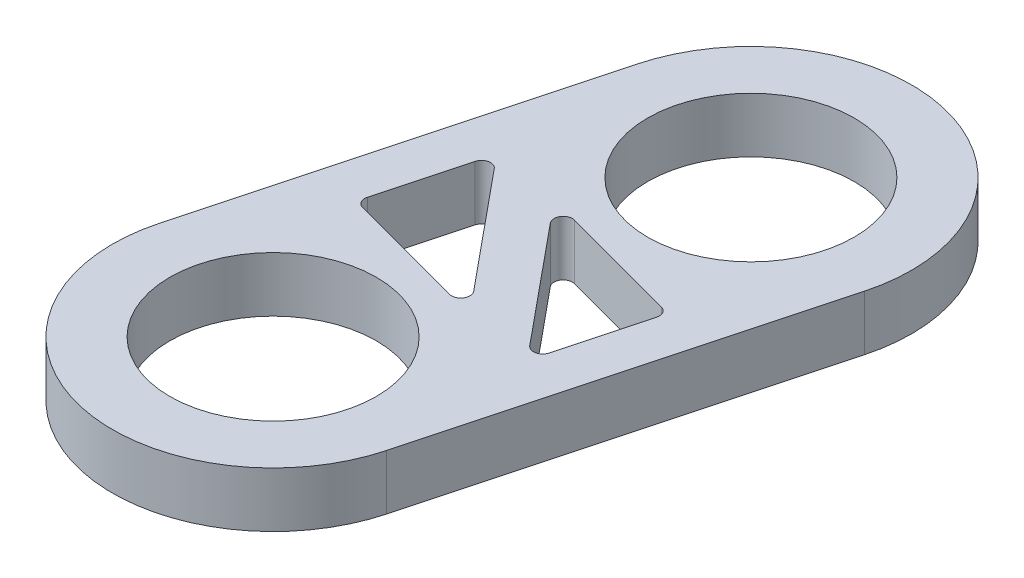
ISO-10303-21;
HEADER;
FILE_DESCRIPTION(('STEP AP214'),'2;1');
FILE_NAME('part.step','',(''),(''),'','','');
FILE_SCHEMA(('AUTOMOTIVE_DESIGN { 1 0 10303 214 1 1 1 1 }'));
ENDSEC;
DATA;
#1=APPLICATION_CONTEXT('core data for automotive mechanical design processes');
#2=APPLICATION_PROTOCOL_DEFINITION('international standard','automotive_design',2000,#1);
#3=PRODUCT_CONTEXT('',#1,'mechanical');
#4=PRODUCT('Part','Part','',(#3));
#5=PRODUCT_RELATED_PRODUCT_CATEGORY('part','',(#4));
#6=PRODUCT_DEFINITION_FORMATION('','',#4);
#7=PRODUCT_DEFINITION_CONTEXT('part definition',#1,'design');
#8=PRODUCT_DEFINITION('design','',#6,#7);
#9=PRODUCT_DEFINITION_SHAPE('','',#8);
#10=(LENGTH_UNIT() NAMED_UNIT(*) SI_UNIT(.MILLI.,.METRE.));
#11=(NAMED_UNIT(*) PLANE_ANGLE_UNIT() SI_UNIT($,.RADIAN.));
#12=(NAMED_UNIT(*) SI_UNIT($,.STERADIAN.) SOLID_ANGLE_UNIT());
#13=UNCERTAINTY_MEASURE_WITH_UNIT(LENGTH_MEASURE(1.E-05),#10,'distance_accuracy_value','');
#14=(GEOMETRIC_REPRESENTATION_CONTEXT(3) GLOBAL_UNCERTAINTY_ASSIGNED_CONTEXT((#13)) GLOBAL_UNIT_ASSIGNED_CONTEXT((#10,
#11,#12)) REPRESENTATION_CONTEXT('',''));
#15=CARTESIAN_POINT('',(0.,0.,0.));
#16=DIRECTION('',(0.,0.,1.));
#17=DIRECTION('',(1.,0.,0.));
#18=AXIS2_PLACEMENT_3D('',#15,#16,#17);
#19=CARTESIAN_POINT('',(0.,7.62,0.));
#20=DIRECTION('',(0.,-1.,0.));
#21=DIRECTION('',(0.,0.,-1.));
#22=AXIS2_PLACEMENT_3D('',#19,#20,#21);
#23=PLANE('',#22);
#24=DIRECTION('',(0.258819045102514,0.,-0.96592582628907));
#25=VECTOR('',#24,1.);
#26=CARTESIAN_POINT('',(10.5329748694649,7.62,22.0266926016672));
#27=LINE('',#26,#25);
#28=CARTESIAN_POINT('',(7.06294922313717,7.62,34.9770046173296));
#29=VERTEX_POINT('',#28);
#30=CARTESIAN_POINT('',(10.2042746821847,7.62,23.2534184010544));
#31=VERTEX_POINT('',#30);
#32=EDGE_CURVE('E366',#29,#31,#27,.T.);
#33=ORIENTED_EDGE('',*,*,#32,.F.);
#34=CARTESIAN_POINT('',(5.83622342375006,7.62,34.6483044300494));
#35=DIRECTION('',(0.,-1.,0.));
#36=DIRECTION('',(0.,0.,-1.));
#37=AXIS2_PLACEMENT_3D('',#34,#35,#36);
#38=CIRCLE('',#37,1.27);
#39=CARTESIAN_POINT('',(4.85572919154385,7.62,35.4554791698737));
#40=VERTEX_POINT('',#39);
#41=EDGE_CURVE('E207',#29,#40,#38,.T.);
#42=ORIENTED_EDGE('',*,*,#41,.T.);
#43=DIRECTION('',(0.635570661278952,0.,0.772042702524566));
#44=VECTOR('',#43,1.);
#45=CARTESIAN_POINT('',(6.42422252846246,7.62,37.3607650940062));
#46=LINE('',#45,#44);
#47=CARTESIAN_POINT('',(-8.41596605219397,7.62,19.3340373109319));
#48=VERTEX_POINT('',#47);
#49=EDGE_CURVE('E371',#48,#40,#46,.T.);
#50=ORIENTED_EDGE('',*,*,#49,.F.);
#51=CARTESIAN_POINT('',(-7.43547181998776,7.62,18.5268625711077));
#52=DIRECTION('',(0.,-1.,0.));
#53=DIRECTION('',(0.,0.,-1.));
#54=AXIS2_PLACEMENT_3D('',#51,#52,#53);
#55=CIRCLE('',#54,1.27);
#56=CARTESIAN_POINT('',(-7.10677163270757,7.62,17.3001367717205));
#57=VERTEX_POINT('',#56);
#58=EDGE_CURVE('E215',#48,#57,#55,.T.);
#59=ORIENTED_EDGE('',*,*,#58,.T.);
#60=DIRECTION('',(-0.96592582628907,0.,-0.258819045102514));
#61=VECTOR('',#60,1.);
#62=CARTESIAN_POINT('',(-10.9347266198097,7.62,16.2744393242639));
#63=LINE('',#62,#61);
#64=CARTESIAN_POINT('',(9.30624907007775,7.62,21.697992414387));
#65=VERTEX_POINT('',#64);
#66=EDGE_CURVE('E367',#65,#57,#63,.T.);
#67=ORIENTED_EDGE('',*,*,#66,.F.);
#68=CARTESIAN_POINT('',(8.97754888279756,7.62,22.9247182137742));
#69=DIRECTION('',(0.,-1.,0.));
#70=DIRECTION('',(0.,0.,-1.));
#71=AXIS2_PLACEMENT_3D('',#68,#69,#70);
#72=CIRCLE('',#71,1.27);
#73=EDGE_CURVE('E211',#65,#31,#72,.T.);
#74=ORIENTED_EDGE('',*,*,#73,.T.);
#75=EDGE_LOOP('',(#33,#42,#50,#59,#67,#74));
#76=FACE_BOUND('',#75,.T.);
#77=DIRECTION('',(0.96592582628907,0.,0.258819045102514));
#78=VECTOR('',#77,1.);
#79=CARTESIAN_POINT('',(-3.0350313395985,7.62,35.8614071496887));
#80=LINE('',#79,#78);
#81=CARTESIAN_POINT('',(-23.276007029486,7.62,30.4378540595655));
#82=VERTEX_POINT('',#81);
#83=CARTESIAN_POINT('',(-6.86298632670064,7.62,34.835709702232));
#84=VERTEX_POINT('',#83);
#85=EDGE_CURVE('E228',#82,#84,#80,.T.);
#86=ORIENTED_EDGE('',*,*,#85,.F.);
#87=CARTESIAN_POINT('',(-22.9473068422058,7.62,29.2111282601784));
#88=DIRECTION('',(0.,-1.,0.));
#89=DIRECTION('',(0.,0.,-1.));
#90=AXIS2_PLACEMENT_3D('',#87,#88,#89);
#91=CIRCLE('',#90,1.27);
#92=CARTESIAN_POINT('',(-24.1740326415929,7.62,28.8824280728982));
#93=VERTEX_POINT('',#92);
#94=EDGE_CURVE('E223',#82,#93,#91,.T.);
#95=ORIENTED_EDGE('',*,*,#94,.T.);
#96=DIRECTION('',(-0.258819045102514,0.,0.96592582628907));
#97=VECTOR('',#96,1.);
#98=CARTESIAN_POINT('',(-24.5027328288731,7.62,30.1091538722853));
#99=LINE('',#98,#97);
#100=CARTESIAN_POINT('',(-21.0327071825454,7.62,17.158841856623));
#101=VERTEX_POINT('',#100);
#102=EDGE_CURVE('E235',#101,#93,#99,.T.);
#103=ORIENTED_EDGE('',*,*,#102,.F.);
#104=CARTESIAN_POINT('',(-19.8059813831583,7.62,17.4875420439032));
#105=DIRECTION('',(0.,-1.,0.));
#106=DIRECTION('',(0.,0.,-1.));
#107=AXIS2_PLACEMENT_3D('',#104,#105,#106);
#108=CIRCLE('',#107,1.27);
#109=CARTESIAN_POINT('',(-18.8254871509521,7.62,16.6803673040789));
#110=VERTEX_POINT('',#109);
#111=EDGE_CURVE('E219',#101,#110,#108,.T.);
#112=ORIENTED_EDGE('',*,*,#111,.T.);
#113=DIRECTION('',(-0.635570661278952,0.,-0.772042702524566));
#114=VECTOR('',#113,1.);
#115=CARTESIAN_POINT('',(-20.3939804878707,7.62,14.7750813799463));
#116=LINE('',#115,#114);
#117=CARTESIAN_POINT('',(-5.55379190721425,7.62,32.8018091630206));
#118=VERTEX_POINT('',#117);
#119=EDGE_CURVE('E230',#118,#110,#116,.T.);
#120=ORIENTED_EDGE('',*,*,#119,.F.);
#121=CARTESIAN_POINT('',(-6.53428613942045,7.62,33.6089839028449));
#122=DIRECTION('',(0.,-1.,0.));
#123=DIRECTION('',(0.,0.,-1.));
#124=AXIS2_PLACEMENT_3D('',#121,#122,#123);
#125=CIRCLE('',#124,1.27);
#126=EDGE_CURVE('E43',#118,#84,#125,.T.);
#127=ORIENTED_EDGE('',*,*,#126,.T.);
#128=EDGE_LOOP('',(#86,#95,#103,#112,#120,#127));
#129=FACE_BOUND('',#128,.T.);
#130=CARTESIAN_POINT('',(0.,7.62,0.));
#131=DIRECTION('',(0.,1.,0.));
#132=DIRECTION('',(0.,0.,-1.));
#133=AXIS2_PLACEMENT_3D('',#130,#131,#132);
#134=CIRCLE('',#133,22.225);
#135=CARTESIAN_POINT('',(21.4677014892746,7.62,5.75225327740338));
#136=VERTEX_POINT('',#135);
#137=CARTESIAN_POINT('',(-21.4677014892746,7.62,-5.75225327740338));
#138=VERTEX_POINT('',#137);
#139=EDGE_CURVE('E159',#136,#138,#134,.T.);
#140=ORIENTED_EDGE('',*,*,#139,.T.);
#141=DIRECTION('',(-0.258819045102514,0.,0.96592582628907));
#142=VECTOR('',#141,1.);
#143=CARTESIAN_POINT('',(-35.4374594486828,7.62,46.3835931965492));
#144=LINE('',#143,#142);
#145=CARTESIAN_POINT('',(-35.4374594486828,7.62,46.3835931965492));
#146=VERTEX_POINT('',#145);
#147=EDGE_CURVE('E149',#138,#146,#144,.T.);
#148=ORIENTED_EDGE('',*,*,#147,.T.);
#149=CARTESIAN_POINT('',(-13.9697579594082,7.62,52.1358464739525));
#150=DIRECTION('',(0.,1.,0.));
#151=DIRECTION('',(0.,0.,1.));
#152=AXIS2_PLACEMENT_3D('',#149,#150,#151);
#153=CIRCLE('',#152,22.225);
#154=CARTESIAN_POINT('',(7.49794352986636,7.62,57.8880997513559));
#155=VERTEX_POINT('',#154);
#156=EDGE_CURVE('E158',#146,#155,#153,.T.);
#157=ORIENTED_EDGE('',*,*,#156,.T.);
#158=DIRECTION('',(0.258819045102515,0.,-0.96592582628907));
#159=VECTOR('',#158,1.);
#160=CARTESIAN_POINT('',(7.49794352986636,7.62,57.8880997513559));
#161=LINE('',#160,#159);
#162=EDGE_CURVE('E164',#155,#136,#161,.T.);
#163=ORIENTED_EDGE('',*,*,#162,.T.);
#164=EDGE_LOOP('',(#140,#148,#157,#163));
#165=FACE_BOUND('',#164,.T.);
#166=CARTESIAN_POINT('',(-13.9697579594082,7.62,52.1358464739525));
#167=DIRECTION('',(0.,1.,0.));
#168=DIRECTION('',(0.,0.,1.));
#169=AXIS2_PLACEMENT_3D('',#166,#167,#168);
#170=CIRCLE('',#169,14.2875);
#171=CARTESIAN_POINT('',(-13.9697579594082,7.62,66.4233464739525));
#172=VERTEX_POINT('',#171);
#173=EDGE_CURVE('E264',#172,#172,#170,.T.);
#174=ORIENTED_EDGE('',*,*,#173,.F.);
#175=EDGE_LOOP('',(#174));
#176=FACE_BOUND('',#175,.T.);
#177=CARTESIAN_POINT('',(0.,7.62,0.));
#178=DIRECTION('',(0.,1.,0.));
#179=DIRECTION('',(0.,0.,1.));
#180=AXIS2_PLACEMENT_3D('',#177,#178,#179);
#181=CIRCLE('',#180,14.2875);
#182=CARTESIAN_POINT('',(0.,7.62,14.2875));
#183=VERTEX_POINT('',#182);
#184=EDGE_CURVE('E251',#183,#183,#181,.T.);
#185=ORIENTED_EDGE('',*,*,#184,.F.);
#186=EDGE_LOOP('',(#185));
#187=FACE_BOUND('',#186,.T.);
#188=ADVANCED_FACE('F35',(#76,#129,#165,#176,#187),#23,.F.);
#189=CARTESIAN_POINT('',(0.,0.,0.));
#190=DIRECTION('',(0.,-1.,0.));
#191=DIRECTION('',(0.,0.,-1.));
#192=AXIS2_PLACEMENT_3D('',#189,#190,#191);
#193=PLANE('',#192);
#194=DIRECTION('',(-0.96592582628907,0.,-0.258819045102514));
#195=VECTOR('',#194,1.);
#196=CARTESIAN_POINT('',(-10.9347266198097,0.,16.2744393242639));
#197=LINE('',#196,#195);
#198=CARTESIAN_POINT('',(9.30624907007775,0.,21.697992414387));
#199=VERTEX_POINT('',#198);
#200=CARTESIAN_POINT('',(-7.10677163270757,0.,17.3001367717205));
#201=VERTEX_POINT('',#200);
#202=EDGE_CURVE('E258',#199,#201,#197,.T.);
#203=ORIENTED_EDGE('',*,*,#202,.T.);
#204=CARTESIAN_POINT('',(-7.43547181998776,0.,18.5268625711077));
#205=DIRECTION('',(0.,-1.,0.));
#206=DIRECTION('',(0.,0.,-1.));
#207=AXIS2_PLACEMENT_3D('',#204,#205,#206);
#208=CIRCLE('',#207,1.27);
#209=CARTESIAN_POINT('',(-8.41596605219397,0.,19.3340373109319));
#210=VERTEX_POINT('',#209);
#211=EDGE_CURVE('E217',#201,#210,#208,.F.);
#212=ORIENTED_EDGE('',*,*,#211,.T.);
#213=DIRECTION('',(0.635570661278952,0.,0.772042702524566));
#214=VECTOR('',#213,1.);
#215=CARTESIAN_POINT('',(6.42422252846246,0.,37.3607650940062));
#216=LINE('',#215,#214);
#217=CARTESIAN_POINT('',(4.85572919154385,0.,35.4554791698737));
#218=VERTEX_POINT('',#217);
#219=EDGE_CURVE('E373',#210,#218,#216,.T.);
#220=ORIENTED_EDGE('',*,*,#219,.T.);
#221=CARTESIAN_POINT('',(5.83622342375006,0.,34.6483044300494));
#222=DIRECTION('',(0.,-1.,0.));
#223=DIRECTION('',(0.,0.,-1.));
#224=AXIS2_PLACEMENT_3D('',#221,#222,#223);
#225=CIRCLE('',#224,1.27);
#226=CARTESIAN_POINT('',(7.06294922313717,0.,34.9770046173296));
#227=VERTEX_POINT('',#226);
#228=EDGE_CURVE('E209',#218,#227,#225,.F.);
#229=ORIENTED_EDGE('',*,*,#228,.T.);
#230=DIRECTION('',(0.258819045102514,0.,-0.96592582628907));
#231=VECTOR('',#230,1.);
#232=CARTESIAN_POINT('',(10.5329748694649,0.,22.0266926016672));
#233=LINE('',#232,#231);
#234=CARTESIAN_POINT('',(10.2042746821847,0.,23.2534184010544));
#235=VERTEX_POINT('',#234);
#236=EDGE_CURVE('E359',#227,#235,#233,.T.);
#237=ORIENTED_EDGE('',*,*,#236,.T.);
#238=CARTESIAN_POINT('',(8.97754888279756,0.,22.9247182137742));
#239=DIRECTION('',(0.,-1.,0.));
#240=DIRECTION('',(0.,0.,-1.));
#241=AXIS2_PLACEMENT_3D('',#238,#239,#240);
#242=CIRCLE('',#241,1.27);
#243=EDGE_CURVE('E213',#235,#199,#242,.F.);
#244=ORIENTED_EDGE('',*,*,#243,.T.);
#245=EDGE_LOOP('',(#203,#212,#220,#229,#237,#244));
#246=FACE_BOUND('',#245,.T.);
#247=DIRECTION('',(-0.635570661278952,0.,-0.772042702524566));
#248=VECTOR('',#247,1.);
#249=CARTESIAN_POINT('',(-20.3939804878707,0.,14.7750813799463));
#250=LINE('',#249,#248);
#251=CARTESIAN_POINT('',(-5.55379190721425,0.,32.8018091630206));
#252=VERTEX_POINT('',#251);
#253=CARTESIAN_POINT('',(-18.8254871509521,0.,16.6803673040789));
#254=VERTEX_POINT('',#253);
#255=EDGE_CURVE('E242',#252,#254,#250,.T.);
#256=ORIENTED_EDGE('',*,*,#255,.T.);
#257=CARTESIAN_POINT('',(-19.8059813831583,0.,17.4875420439032));
#258=DIRECTION('',(0.,-1.,0.));
#259=DIRECTION('',(0.,0.,-1.));
#260=AXIS2_PLACEMENT_3D('',#257,#258,#259);
#261=CIRCLE('',#260,1.27);
#262=CARTESIAN_POINT('',(-21.0327071825454,0.,17.158841856623));
#263=VERTEX_POINT('',#262);
#264=EDGE_CURVE('E221',#254,#263,#261,.F.);
#265=ORIENTED_EDGE('',*,*,#264,.T.);
#266=DIRECTION('',(-0.258819045102514,0.,0.96592582628907));
#267=VECTOR('',#266,1.);
#268=CARTESIAN_POINT('',(-24.5027328288731,0.,30.1091538722853));
#269=LINE('',#268,#267);
#270=CARTESIAN_POINT('',(-24.1740326415929,0.,28.8824280728982));
#271=VERTEX_POINT('',#270);
#272=EDGE_CURVE('E253',#263,#271,#269,.T.);
#273=ORIENTED_EDGE('',*,*,#272,.T.);
#274=CARTESIAN_POINT('',(-22.9473068422058,0.,29.2111282601784));
#275=DIRECTION('',(0.,-1.,0.));
#276=DIRECTION('',(0.,0.,-1.));
#277=AXIS2_PLACEMENT_3D('',#274,#275,#276);
#278=CIRCLE('',#277,1.27);
#279=CARTESIAN_POINT('',(-23.276007029486,0.,30.4378540595655));
#280=VERTEX_POINT('',#279);
#281=EDGE_CURVE('E57',#271,#280,#278,.F.);
#282=ORIENTED_EDGE('',*,*,#281,.T.);
#283=DIRECTION('',(0.96592582628907,0.,0.258819045102514));
#284=VECTOR('',#283,1.);
#285=CARTESIAN_POINT('',(-3.0350313395985,0.,35.8614071496887));
#286=LINE('',#285,#284);
#287=CARTESIAN_POINT('',(-6.86298632670064,0.,34.835709702232));
#288=VERTEX_POINT('',#287);
#289=EDGE_CURVE('E244',#280,#288,#286,.T.);
#290=ORIENTED_EDGE('',*,*,#289,.T.);
#291=CARTESIAN_POINT('',(-6.53428613942045,0.,33.6089839028449));
#292=DIRECTION('',(0.,-1.,0.));
#293=DIRECTION('',(0.,0.,-1.));
#294=AXIS2_PLACEMENT_3D('',#291,#292,#293);
#295=CIRCLE('',#294,1.27);
#296=EDGE_CURVE('E11',#288,#252,#295,.F.);
#297=ORIENTED_EDGE('',*,*,#296,.T.);
#298=EDGE_LOOP('',(#256,#265,#273,#282,#290,#297));
#299=FACE_BOUND('',#298,.T.);
#300=CARTESIAN_POINT('',(-13.9697579594082,0.,52.1358464739525));
#301=DIRECTION('',(0.,1.,0.));
#302=DIRECTION('',(0.,0.,1.));
#303=AXIS2_PLACEMENT_3D('',#300,#301,#302);
#304=CIRCLE('',#303,14.2875);
#305=CARTESIAN_POINT('',(-13.9697579594082,0.,66.4233464739525));
#306=VERTEX_POINT('',#305);
#307=EDGE_CURVE('E262',#306,#306,#304,.T.);
#308=ORIENTED_EDGE('',*,*,#307,.T.);
#309=EDGE_LOOP('',(#308));
#310=FACE_BOUND('',#309,.T.);
#311=DIRECTION('',(-0.258819045102514,0.,0.96592582628907));
#312=VECTOR('',#311,1.);
#313=CARTESIAN_POINT('',(-35.4374594486828,0.,46.3835931965492));
#314=LINE('',#313,#312);
#315=CARTESIAN_POINT('',(-21.4677014892746,0.,-5.75225327740338));
#316=VERTEX_POINT('',#315);
#317=CARTESIAN_POINT('',(-35.4374594486828,0.,46.3835931965492));
#318=VERTEX_POINT('',#317);
#319=EDGE_CURVE('E267',#316,#318,#314,.T.);
#320=ORIENTED_EDGE('',*,*,#319,.F.);
#321=CARTESIAN_POINT('',(0.,0.,0.));
#322=DIRECTION('',(0.,1.,0.));
#323=DIRECTION('',(0.,0.,1.));
#324=AXIS2_PLACEMENT_3D('',#321,#322,#323);
#325=CIRCLE('',#324,22.225);
#326=CARTESIAN_POINT('',(21.4677014892746,0.,5.75225327740338));
#327=VERTEX_POINT('',#326);
#328=EDGE_CURVE('E168',#327,#316,#325,.T.);
#329=ORIENTED_EDGE('',*,*,#328,.F.);
#330=DIRECTION('',(0.258819045102515,0.,-0.96592582628907));
#331=VECTOR('',#330,1.);
#332=CARTESIAN_POINT('',(7.49794352986636,0.,57.8880997513559));
#333=LINE('',#332,#331);
#334=CARTESIAN_POINT('',(7.49794352986636,0.,57.8880997513559));
#335=VERTEX_POINT('',#334);
#336=EDGE_CURVE('E276',#335,#327,#333,.T.);
#337=ORIENTED_EDGE('',*,*,#336,.F.);
#338=CARTESIAN_POINT('',(-13.9697579594082,0.,52.1358464739525));
#339=DIRECTION('',(0.,1.,0.));
#340=DIRECTION('',(0.,0.,1.));
#341=AXIS2_PLACEMENT_3D('',#338,#339,#340);
#342=CIRCLE('',#341,22.225);
#343=EDGE_CURVE('E274',#318,#335,#342,.T.);
#344=ORIENTED_EDGE('',*,*,#343,.F.);
#345=EDGE_LOOP('',(#320,#329,#337,#344));
#346=FACE_BOUND('',#345,.T.);
#347=CARTESIAN_POINT('',(0.,0.,0.));
#348=DIRECTION('',(0.,1.,0.));
#349=DIRECTION('',(0.,0.,1.));
#350=AXIS2_PLACEMENT_3D('',#347,#348,#349);
#351=CIRCLE('',#350,14.2875);
#352=CARTESIAN_POINT('',(0.,0.,14.2875));
#353=VERTEX_POINT('',#352);
#354=EDGE_CURVE('E248',#353,#353,#351,.T.);
#355=ORIENTED_EDGE('',*,*,#354,.T.);
#356=EDGE_LOOP('',(#355));
#357=FACE_BOUND('',#356,.T.);
#358=ADVANCED_FACE('F240',(#246,#299,#310,#346,#357),#193,.T.);
#359=CARTESIAN_POINT('',(-35.4374594486828,7.62,46.3835931965492));
#360=DIRECTION('',(0.96592582628907,0.,0.258819045102514));
#361=DIRECTION('',(0.258819045102514,0.,-0.96592582628907));
#362=AXIS2_PLACEMENT_3D('',#359,#360,#361);
#363=PLANE('',#362);
#364=ORIENTED_EDGE('',*,*,#319,.T.);
#365=DIRECTION('',(0.,-1.,0.));
#366=VECTOR('',#365,1.);
#367=CARTESIAN_POINT('',(-35.4374594486828,7.62,46.3835931965492));
#368=LINE('',#367,#366);
#369=EDGE_CURVE('E155',#146,#318,#368,.T.);
#370=ORIENTED_EDGE('',*,*,#369,.F.);
#371=ORIENTED_EDGE('',*,*,#147,.F.);
#372=DIRECTION('',(0.,-1.,0.));
#373=VECTOR('',#372,1.);
#374=CARTESIAN_POINT('',(-21.4677014892746,7.62,-5.75225327740338));
#375=LINE('',#374,#373);
#376=EDGE_CURVE('E153',#138,#316,#375,.T.);
#377=ORIENTED_EDGE('',*,*,#376,.T.);
#378=EDGE_LOOP('',(#364,#370,#371,#377));
#379=FACE_BOUND('',#378,.T.);
#380=ADVANCED_FACE('F151',(#379),#363,.F.);
#381=CARTESIAN_POINT('',(-13.9697579594082,7.62,52.1358464739525));
#382=DIRECTION('',(0.,-1.,0.));
#383=DIRECTION('',(0.,0.,-1.));
#384=AXIS2_PLACEMENT_3D('',#381,#382,#383);
#385=CYLINDRICAL_SURFACE('',#384,22.225);
#386=ORIENTED_EDGE('',*,*,#343,.T.);
#387=DIRECTION('',(0.,-1.,0.));
#388=VECTOR('',#387,1.);
#389=CARTESIAN_POINT('',(7.49794352986636,7.62,57.8880997513559));
#390=LINE('',#389,#388);
#391=EDGE_CURVE('E177',#155,#335,#390,.T.);
#392=ORIENTED_EDGE('',*,*,#391,.F.);
#393=ORIENTED_EDGE('',*,*,#156,.F.);
#394=ORIENTED_EDGE('',*,*,#369,.T.);
#395=EDGE_LOOP('',(#386,#392,#393,#394));
#396=FACE_BOUND('',#395,.T.);
#397=ADVANCED_FACE('F288',(#396),#385,.T.);
#398=CARTESIAN_POINT('',(7.49794352986636,7.62,57.8880997513559));
#399=DIRECTION('',(-0.96592582628907,0.,-0.258819045102515));
#400=DIRECTION('',(-0.258819045102515,0.,0.96592582628907));
#401=AXIS2_PLACEMENT_3D('',#398,#399,#400);
#402=PLANE('',#401);
#403=ORIENTED_EDGE('',*,*,#336,.T.);
#404=DIRECTION('',(0.,-1.,0.));
#405=VECTOR('',#404,1.);
#406=CARTESIAN_POINT('',(21.4677014892746,7.62,5.75225327740338));
#407=LINE('',#406,#405);
#408=EDGE_CURVE('E272',#136,#327,#407,.T.);
#409=ORIENTED_EDGE('',*,*,#408,.F.);
#410=ORIENTED_EDGE('',*,*,#162,.F.);
#411=ORIENTED_EDGE('',*,*,#391,.T.);
#412=EDGE_LOOP('',(#403,#409,#410,#411));
#413=FACE_BOUND('',#412,.T.);
#414=ADVANCED_FACE('F283',(#413),#402,.F.);
#415=CARTESIAN_POINT('',(0.,7.62,0.));
#416=DIRECTION('',(0.,-1.,0.));
#417=DIRECTION('',(0.,0.,-1.));
#418=AXIS2_PLACEMENT_3D('',#415,#416,#417);
#419=CYLINDRICAL_SURFACE('',#418,22.225);
#420=ORIENTED_EDGE('',*,*,#328,.T.);
#421=ORIENTED_EDGE('',*,*,#376,.F.);
#422=ORIENTED_EDGE('',*,*,#139,.F.);
#423=ORIENTED_EDGE('',*,*,#408,.T.);
#424=EDGE_LOOP('',(#420,#421,#422,#423));
#425=FACE_BOUND('',#424,.T.);
#426=ADVANCED_FACE('F170',(#425),#419,.T.);
#427=CARTESIAN_POINT('',(-13.9697579594082,7.62,52.1358464739525));
#428=DIRECTION('',(0.,-1.,0.));
#429=DIRECTION('',(0.,0.,-1.));
#430=AXIS2_PLACEMENT_3D('',#427,#428,#429);
#431=CYLINDRICAL_SURFACE('',#430,14.2875);
#432=ORIENTED_EDGE('',*,*,#173,.T.);
#433=EDGE_LOOP('',(#432));
#434=FACE_BOUND('',#433,.T.);
#435=ORIENTED_EDGE('',*,*,#307,.F.);
#436=EDGE_LOOP('',(#435));
#437=FACE_BOUND('',#436,.T.);
#438=ADVANCED_FACE('F307',(#434,#437),#431,.F.);
#439=CARTESIAN_POINT('',(0.,7.62,0.));
#440=DIRECTION('',(0.,-1.,0.));
#441=DIRECTION('',(0.,0.,-1.));
#442=AXIS2_PLACEMENT_3D('',#439,#440,#441);
#443=CYLINDRICAL_SURFACE('',#442,14.2875);
#444=ORIENTED_EDGE('',*,*,#184,.T.);
#445=EDGE_LOOP('',(#444));
#446=FACE_BOUND('',#445,.T.);
#447=ORIENTED_EDGE('',*,*,#354,.F.);
#448=EDGE_LOOP('',(#447));
#449=FACE_BOUND('',#448,.T.);
#450=ADVANCED_FACE('F314',(#446,#449),#443,.F.);
#451=CARTESIAN_POINT('',(-24.5027328288731,0.,30.1091538722853));
#452=DIRECTION('',(-0.96592582628907,0.,-0.258819045102514));
#453=DIRECTION('',(-0.258819045102514,0.,0.96592582628907));
#454=AXIS2_PLACEMENT_3D('',#451,#452,#453);
#455=PLANE('',#454);
#456=ORIENTED_EDGE('',*,*,#272,.F.);
#457=DIRECTION('',(0.,1.,0.));
#458=VECTOR('',#457,1.);
#459=CARTESIAN_POINT('',(-21.0327071825454,7.62,17.158841856623));
#460=LINE('',#459,#458);
#461=EDGE_CURVE('E195',#263,#101,#460,.T.);
#462=ORIENTED_EDGE('',*,*,#461,.T.);
#463=ORIENTED_EDGE('',*,*,#102,.T.);
#464=DIRECTION('',(0.,1.,0.));
#465=VECTOR('',#464,1.);
#466=CARTESIAN_POINT('',(-24.1740326415929,0.,28.8824280728982));
#467=LINE('',#466,#465);
#468=EDGE_CURVE('E193',#93,#271,#467,.F.);
#469=ORIENTED_EDGE('',*,*,#468,.T.);
#470=EDGE_LOOP('',(#456,#462,#463,#469));
#471=FACE_BOUND('',#470,.T.);
#472=ADVANCED_FACE('F319',(#471),#455,.F.);
#473=CARTESIAN_POINT('',(-20.3939804878707,0.,14.7750813799463));
#474=DIRECTION('',(0.772042702524566,0.,-0.635570661278952));
#475=DIRECTION('',(-0.635570661278952,0.,-0.772042702524566));
#476=AXIS2_PLACEMENT_3D('',#473,#474,#475);
#477=PLANE('',#476);
#478=ORIENTED_EDGE('',*,*,#119,.T.);
#479=DIRECTION('',(0.,1.,0.));
#480=VECTOR('',#479,1.);
#481=CARTESIAN_POINT('',(-18.8254871509521,0.,16.6803673040789));
#482=LINE('',#481,#480);
#483=EDGE_CURVE('E201',#110,#254,#482,.F.);
#484=ORIENTED_EDGE('',*,*,#483,.T.);
#485=ORIENTED_EDGE('',*,*,#255,.F.);
#486=DIRECTION('',(0.,1.,0.));
#487=VECTOR('',#486,1.);
#488=CARTESIAN_POINT('',(-5.55379190721425,7.62,32.8018091630206));
#489=LINE('',#488,#487);
#490=EDGE_CURVE('E198',#252,#118,#489,.T.);
#491=ORIENTED_EDGE('',*,*,#490,.T.);
#492=EDGE_LOOP('',(#478,#484,#485,#491));
#493=FACE_BOUND('',#492,.T.);
#494=ADVANCED_FACE('F246',(#493),#477,.F.);
#495=CARTESIAN_POINT('',(-3.0350313395985,0.,35.8614071496887));
#496=DIRECTION('',(-0.258819045102514,0.,0.96592582628907));
#497=DIRECTION('',(0.96592582628907,0.,0.258819045102514));
#498=AXIS2_PLACEMENT_3D('',#495,#496,#497);
#499=PLANE('',#498);
#500=ORIENTED_EDGE('',*,*,#289,.F.);
#501=DIRECTION('',(0.,1.,0.));
#502=VECTOR('',#501,1.);
#503=CARTESIAN_POINT('',(-23.276007029486,7.62,30.4378540595655));
#504=LINE('',#503,#502);
#505=EDGE_CURVE('E204',#280,#82,#504,.T.);
#506=ORIENTED_EDGE('',*,*,#505,.T.);
#507=ORIENTED_EDGE('',*,*,#85,.T.);
#508=DIRECTION('',(0.,1.,0.));
#509=VECTOR('',#508,1.);
#510=CARTESIAN_POINT('',(-6.86298632670064,0.,34.835709702232));
#511=LINE('',#510,#509);
#512=EDGE_CURVE('E50',#84,#288,#511,.F.);
#513=ORIENTED_EDGE('',*,*,#512,.T.);
#514=EDGE_LOOP('',(#500,#506,#507,#513));
#515=FACE_BOUND('',#514,.T.);
#516=ADVANCED_FACE('F233',(#515),#499,.F.);
#517=CARTESIAN_POINT('',(6.42422252846246,0.,37.3607650940062));
#518=DIRECTION('',(-0.772042702524566,0.,0.635570661278952));
#519=DIRECTION('',(0.635570661278952,0.,0.772042702524566));
#520=AXIS2_PLACEMENT_3D('',#517,#518,#519);
#521=PLANE('',#520);
#522=ORIENTED_EDGE('',*,*,#49,.T.);
#523=DIRECTION('',(0.,1.,0.));
#524=VECTOR('',#523,1.);
#525=CARTESIAN_POINT('',(4.85572919154386,0.,35.4554791698737));
#526=LINE('',#525,#524);
#527=EDGE_CURVE('E186',#40,#218,#526,.F.);
#528=ORIENTED_EDGE('',*,*,#527,.T.);
#529=ORIENTED_EDGE('',*,*,#219,.F.);
#530=DIRECTION('',(0.,1.,0.));
#531=VECTOR('',#530,1.);
#532=CARTESIAN_POINT('',(-8.41596605219396,7.62,19.3340373109319));
#533=LINE('',#532,#531);
#534=EDGE_CURVE('E183',#210,#48,#533,.T.);
#535=ORIENTED_EDGE('',*,*,#534,.T.);
#536=EDGE_LOOP('',(#522,#528,#529,#535));
#537=FACE_BOUND('',#536,.T.);
#538=ADVANCED_FACE('F336',(#537),#521,.F.);
#539=CARTESIAN_POINT('',(-10.9347266198097,0.,16.2744393242639));
#540=DIRECTION('',(0.258819045102515,0.,-0.96592582628907));
#541=DIRECTION('',(-0.96592582628907,0.,-0.258819045102515));
#542=AXIS2_PLACEMENT_3D('',#539,#540,#541);
#543=PLANE('',#542);
#544=ORIENTED_EDGE('',*,*,#202,.F.);
#545=DIRECTION('',(0.,1.,0.));
#546=VECTOR('',#545,1.);
#547=CARTESIAN_POINT('',(9.30624907007775,7.62,21.697992414387));
#548=LINE('',#547,#546);
#549=EDGE_CURVE('E190',#199,#65,#548,.T.);
#550=ORIENTED_EDGE('',*,*,#549,.T.);
#551=ORIENTED_EDGE('',*,*,#66,.T.);
#552=DIRECTION('',(0.,1.,0.));
#553=VECTOR('',#552,1.);
#554=CARTESIAN_POINT('',(-7.10677163270757,0.,17.3001367717205));
#555=LINE('',#554,#553);
#556=EDGE_CURVE('E188',#57,#201,#555,.F.);
#557=ORIENTED_EDGE('',*,*,#556,.T.);
#558=EDGE_LOOP('',(#544,#550,#551,#557));
#559=FACE_BOUND('',#558,.T.);
#560=ADVANCED_FACE('F341',(#559),#543,.F.);
#561=CARTESIAN_POINT('',(10.5329748694649,0.,22.0266926016672));
#562=DIRECTION('',(0.96592582628907,0.,0.258819045102515));
#563=DIRECTION('',(0.258819045102515,0.,-0.96592582628907));
#564=AXIS2_PLACEMENT_3D('',#561,#562,#563);
#565=PLANE('',#564);
#566=ORIENTED_EDGE('',*,*,#236,.F.);
#567=DIRECTION('',(0.,1.,0.));
#568=VECTOR('',#567,1.);
#569=CARTESIAN_POINT('',(7.06294922313717,7.62,34.9770046173296));
#570=LINE('',#569,#568);
#571=EDGE_CURVE('E175',#227,#29,#570,.T.);
#572=ORIENTED_EDGE('',*,*,#571,.T.);
#573=ORIENTED_EDGE('',*,*,#32,.T.);
#574=DIRECTION('',(0.,1.,0.));
#575=VECTOR('',#574,1.);
#576=CARTESIAN_POINT('',(10.2042746821847,0.,23.2534184010544));
#577=LINE('',#576,#575);
#578=EDGE_CURVE('E173',#31,#235,#577,.F.);
#579=ORIENTED_EDGE('',*,*,#578,.T.);
#580=EDGE_LOOP('',(#566,#572,#573,#579));
#581=FACE_BOUND('',#580,.T.);
#582=ADVANCED_FACE('F343',(#581),#565,.F.);
#583=CARTESIAN_POINT('',(5.83622342375006,0.,34.6483044300494));
#584=DIRECTION('',(0.,-1.,0.));
#585=DIRECTION('',(0.,0.,-1.));
#586=AXIS2_PLACEMENT_3D('',#583,#584,#585);
#587=CYLINDRICAL_SURFACE('',#586,1.27);
#588=ORIENTED_EDGE('',*,*,#228,.F.);
#589=ORIENTED_EDGE('',*,*,#527,.F.);
#590=ORIENTED_EDGE('',*,*,#41,.F.);
#591=ORIENTED_EDGE('',*,*,#571,.F.);
#592=EDGE_LOOP('',(#588,#589,#590,#591));
#593=FACE_BOUND('',#592,.T.);
#594=ADVANCED_FACE('F346',(#593),#587,.F.);
#595=CARTESIAN_POINT('',(8.97754888279756,0.,22.9247182137742));
#596=DIRECTION('',(0.,-1.,0.));
#597=DIRECTION('',(0.,0.,-1.));
#598=AXIS2_PLACEMENT_3D('',#595,#596,#597);
#599=CYLINDRICAL_SURFACE('',#598,1.27);
#600=ORIENTED_EDGE('',*,*,#243,.F.);
#601=ORIENTED_EDGE('',*,*,#578,.F.);
#602=ORIENTED_EDGE('',*,*,#73,.F.);
#603=ORIENTED_EDGE('',*,*,#549,.F.);
#604=EDGE_LOOP('',(#600,#601,#602,#603));
#605=FACE_BOUND('',#604,.T.);
#606=ADVANCED_FACE('F363',(#605),#599,.F.);
#607=CARTESIAN_POINT('',(-7.43547181998776,0.,18.5268625711077));
#608=DIRECTION('',(0.,-1.,0.));
#609=DIRECTION('',(0.,0.,-1.));
#610=AXIS2_PLACEMENT_3D('',#607,#608,#609);
#611=CYLINDRICAL_SURFACE('',#610,1.27);
#612=ORIENTED_EDGE('',*,*,#211,.F.);
#613=ORIENTED_EDGE('',*,*,#556,.F.);
#614=ORIENTED_EDGE('',*,*,#58,.F.);
#615=ORIENTED_EDGE('',*,*,#534,.F.);
#616=EDGE_LOOP('',(#612,#613,#614,#615));
#617=FACE_BOUND('',#616,.T.);
#618=ADVANCED_FACE('F386',(#617),#611,.F.);
#619=CARTESIAN_POINT('',(-19.8059813831583,0.,17.4875420439032));
#620=DIRECTION('',(0.,-1.,0.));
#621=DIRECTION('',(0.,0.,-1.));
#622=AXIS2_PLACEMENT_3D('',#619,#620,#621);
#623=CYLINDRICAL_SURFACE('',#622,1.27);
#624=ORIENTED_EDGE('',*,*,#264,.F.);
#625=ORIENTED_EDGE('',*,*,#483,.F.);
#626=ORIENTED_EDGE('',*,*,#111,.F.);
#627=ORIENTED_EDGE('',*,*,#461,.F.);
#628=EDGE_LOOP('',(#624,#625,#626,#627));
#629=FACE_BOUND('',#628,.T.);
#630=ADVANCED_FACE('F384',(#629),#623,.F.);
#631=CARTESIAN_POINT('',(-22.9473068422058,0.,29.2111282601784));
#632=DIRECTION('',(0.,-1.,0.));
#633=DIRECTION('',(0.,0.,-1.));
#634=AXIS2_PLACEMENT_3D('',#631,#632,#633);
#635=CYLINDRICAL_SURFACE('',#634,1.27);
#636=ORIENTED_EDGE('',*,*,#281,.F.);
#637=ORIENTED_EDGE('',*,*,#468,.F.);
#638=ORIENTED_EDGE('',*,*,#94,.F.);
#639=ORIENTED_EDGE('',*,*,#505,.F.);
#640=EDGE_LOOP('',(#636,#637,#638,#639));
#641=FACE_BOUND('',#640,.T.);
#642=ADVANCED_FACE('F381',(#641),#635,.F.);
#643=CARTESIAN_POINT('',(-6.53428613942045,0.,33.6089839028449));
#644=DIRECTION('',(0.,-1.,0.));
#645=DIRECTION('',(0.,0.,-1.));
#646=AXIS2_PLACEMENT_3D('',#643,#644,#645);
#647=CYLINDRICAL_SURFACE('',#646,1.27);
#648=ORIENTED_EDGE('',*,*,#296,.F.);
#649=ORIENTED_EDGE('',*,*,#512,.F.);
#650=ORIENTED_EDGE('',*,*,#126,.F.);
#651=ORIENTED_EDGE('',*,*,#490,.F.);
#652=EDGE_LOOP('',(#648,#649,#650,#651));
#653=FACE_BOUND('',#652,.T.);
#654=ADVANCED_FACE('F37',(#653),#647,.F.);
#655=CLOSED_SHELL('',(#188,#358,#380,#397,#414,#426,#438,#450,#472,#494,#516,#538,#560,#582,
#594,#606,#618,#630,#642,#654));
#656=MANIFOLD_SOLID_BREP('B2',#655);
#657=ADVANCED_BREP_SHAPE_REPRESENTATION('',(#18,#656),#14);
#658=SHAPE_DEFINITION_REPRESENTATION(#9,#657);
ENDSEC;
END-ISO-10303-21;
